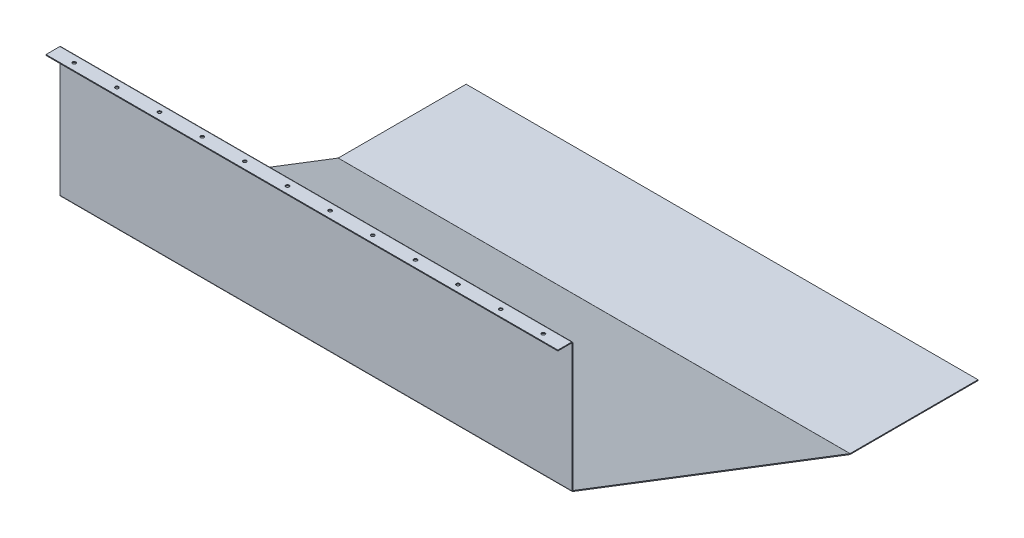
ISO-10303-21;
HEADER;
FILE_DESCRIPTION(('STEP AP214'),'2;1');
FILE_NAME('part.step','',(''),(''),'','','');
FILE_SCHEMA(('AUTOMOTIVE_DESIGN { 1 0 10303 214 1 1 1 1 }'));
ENDSEC;
DATA;
#1=APPLICATION_CONTEXT('core data for automotive mechanical design processes');
#2=APPLICATION_PROTOCOL_DEFINITION('international standard','automotive_design',2000,#1);
#3=PRODUCT_CONTEXT('',#1,'mechanical');
#4=PRODUCT('Part','Part','',(#3));
#5=PRODUCT_RELATED_PRODUCT_CATEGORY('part','',(#4));
#6=PRODUCT_DEFINITION_FORMATION('','',#4);
#7=PRODUCT_DEFINITION_CONTEXT('part definition',#1,'design');
#8=PRODUCT_DEFINITION('design','',#6,#7);
#9=PRODUCT_DEFINITION_SHAPE('','',#8);
#10=(LENGTH_UNIT() NAMED_UNIT(*) SI_UNIT(.MILLI.,.METRE.));
#11=(NAMED_UNIT(*) PLANE_ANGLE_UNIT() SI_UNIT($,.RADIAN.));
#12=(NAMED_UNIT(*) SI_UNIT($,.STERADIAN.) SOLID_ANGLE_UNIT());
#13=UNCERTAINTY_MEASURE_WITH_UNIT(LENGTH_MEASURE(1.E-05),#10,'distance_accuracy_value','');
#14=(GEOMETRIC_REPRESENTATION_CONTEXT(3) GLOBAL_UNCERTAINTY_ASSIGNED_CONTEXT((#13)) GLOBAL_UNIT_ASSIGNED_CONTEXT((#10,
#11,#12)) REPRESENTATION_CONTEXT('',''));
#15=CARTESIAN_POINT('',(0.,0.,0.));
#16=DIRECTION('',(0.,0.,1.));
#17=DIRECTION('',(1.,0.,0.));
#18=AXIS2_PLACEMENT_3D('',#15,#16,#17);
#19=CARTESIAN_POINT('',(600.,-300.181606157762,-0.472176010181132));
#20=DIRECTION('',(1.,0.,0.));
#21=DIRECTION('',(0.,0.,-1.));
#22=AXIS2_PLACEMENT_3D('',#19,#20,#21);
#23=PLANE('',#22);
#24=DIRECTION('',(0.,-0.933345606203062,0.358979079308862));
#25=VECTOR('',#24,1.);
#26=CARTESIAN_POINT('',(600.,-300.181606157762,-0.472176010181132));
#27=LINE('',#26,#25);
#28=CARTESIAN_POINT('',(600.,-300.181606157762,-0.472176010181132));
#29=VERTEX_POINT('',#28);
#30=CARTESIAN_POINT('',(600.,-302.048297370168,0.245782148436592));
#31=VERTEX_POINT('',#30);
#32=EDGE_CURVE('E13',#29,#31,#27,.T.);
#33=ORIENTED_EDGE('',*,*,#32,.F.);
#34=CARTESIAN_POINT('',(600.,-299.494103784233,-0.73660000000003));
#35=DIRECTION('',(-1.,0.,0.));
#36=DIRECTION('',(0.,0.,1.));
#37=AXIS2_PLACEMENT_3D('',#34,#35,#36);
#38=CIRCLE('',#37,0.7366);
#39=CARTESIAN_POINT('',(600.,-299.494103784233,0.));
#40=VERTEX_POINT('',#39);
#41=EDGE_CURVE('E202',#29,#40,#38,.T.);
#42=ORIENTED_EDGE('',*,*,#41,.T.);
#43=DIRECTION('',(0.,0.,-1.));
#44=VECTOR('',#43,1.);
#45=CARTESIAN_POINT('',(600.,-299.494103784233,1.99999999999996));
#46=LINE('',#45,#44);
#47=CARTESIAN_POINT('',(600.,-299.494103784233,1.99999999999996));
#48=VERTEX_POINT('',#47);
#49=EDGE_CURVE('E73',#48,#40,#46,.T.);
#50=ORIENTED_EDGE('',*,*,#49,.F.);
#51=CARTESIAN_POINT('',(600.,-299.494103784233,-0.73660000000003));
#52=DIRECTION('',(1.,0.,0.));
#53=DIRECTION('',(0.,0.,-1.));
#54=AXIS2_PLACEMENT_3D('',#51,#52,#53);
#55=CIRCLE('',#54,2.7366);
#56=EDGE_CURVE('E304',#31,#48,#55,.F.);
#57=ORIENTED_EDGE('',*,*,#56,.F.);
#58=EDGE_LOOP('',(#33,#42,#50,#57));
#59=FACE_BOUND('',#58,.T.);
#60=ADVANCED_FACE('F64',(#59),#23,.T.);
#61=CARTESIAN_POINT('',(600.,-299.494103784233,1.99999999999996));
#62=DIRECTION('',(1.,0.,0.));
#63=DIRECTION('',(0.,0.,-1.));
#64=AXIS2_PLACEMENT_3D('',#61,#62,#63);
#65=PLANE('',#64);
#66=DIRECTION('',(0.,0.358979079308869,0.93334560620306));
#67=VECTOR('',#66,1.);
#68=CARTESIAN_POINT('',(600.,-300.,0.));
#69=LINE('',#68,#67);
#70=CARTESIAN_POINT('',(600.,-549.95090237353,-649.872346171177));
#71=VERTEX_POINT('',#70);
#72=EDGE_CURVE('E165',#71,#29,#69,.T.);
#73=ORIENTED_EDGE('',*,*,#72,.T.);
#74=ORIENTED_EDGE('',*,*,#32,.T.);
#75=DIRECTION('',(0.,0.358979079308869,0.93334560620306));
#76=VECTOR('',#75,1.);
#77=CARTESIAN_POINT('',(600.,-301.866691212406,0.717958158617702));
#78=LINE('',#77,#76);
#79=CARTESIAN_POINT('',(600.,-551.817593585936,-649.154388012559));
#80=VERTEX_POINT('',#79);
#81=EDGE_CURVE('E168',#80,#31,#78,.T.);
#82=ORIENTED_EDGE('',*,*,#81,.F.);
#83=DIRECTION('',(0.,0.933345606203095,-0.358979079308776));
#84=VECTOR('',#83,1.);
#85=CARTESIAN_POINT('',(600.,-551.817593585936,-649.154388012559));
#86=LINE('',#85,#84);
#87=EDGE_CURVE('E161',#80,#71,#86,.T.);
#88=ORIENTED_EDGE('',*,*,#87,.T.);
#89=EDGE_LOOP('',(#73,#74,#82,#88));
#90=FACE_BOUND('',#89,.T.);
#91=ADVANCED_FACE('F163',(#90),#65,.T.);
#92=CARTESIAN_POINT('',(-600.,-299.494103784233,0.));
#93=DIRECTION('',(-1.,0.,0.));
#94=DIRECTION('',(0.,0.,1.));
#95=AXIS2_PLACEMENT_3D('',#92,#93,#94);
#96=PLANE('',#95);
#97=DIRECTION('',(0.,0.,1.));
#98=VECTOR('',#97,1.);
#99=CARTESIAN_POINT('',(-600.,-299.494103784233,0.));
#100=LINE('',#99,#98);
#101=CARTESIAN_POINT('',(-600.,-299.494103784233,0.));
#102=VERTEX_POINT('',#101);
#103=CARTESIAN_POINT('',(-600.,-299.494103784233,1.99999999999996));
#104=VERTEX_POINT('',#103);
#105=EDGE_CURVE('E126',#102,#104,#100,.T.);
#106=ORIENTED_EDGE('',*,*,#105,.F.);
#107=CARTESIAN_POINT('',(-600.,-299.494103784233,-0.73660000000003));
#108=DIRECTION('',(-1.,0.,0.));
#109=DIRECTION('',(0.,0.,1.));
#110=AXIS2_PLACEMENT_3D('',#107,#108,#109);
#111=CIRCLE('',#110,0.7366);
#112=CARTESIAN_POINT('',(-600.,-300.181606157762,-0.472176010181132));
#113=VERTEX_POINT('',#112);
#114=EDGE_CURVE('E252',#113,#102,#111,.T.);
#115=ORIENTED_EDGE('',*,*,#114,.F.);
#116=DIRECTION('',(0.,0.933345606203062,-0.358979079308862));
#117=VECTOR('',#116,1.);
#118=CARTESIAN_POINT('',(-600.,-302.048297370168,0.245782148436592));
#119=LINE('',#118,#117);
#120=CARTESIAN_POINT('',(-600.,-302.048297370168,0.245782148436592));
#121=VERTEX_POINT('',#120);
#122=EDGE_CURVE('E119',#121,#113,#119,.T.);
#123=ORIENTED_EDGE('',*,*,#122,.F.);
#124=CARTESIAN_POINT('',(-600.,-299.494103784233,-0.73660000000003));
#125=DIRECTION('',(1.,0.,0.));
#126=DIRECTION('',(0.,0.,-1.));
#127=AXIS2_PLACEMENT_3D('',#124,#125,#126);
#128=CIRCLE('',#127,2.7366);
#129=EDGE_CURVE('E225',#121,#104,#128,.F.);
#130=ORIENTED_EDGE('',*,*,#129,.T.);
#131=EDGE_LOOP('',(#106,#115,#123,#130));
#132=FACE_BOUND('',#131,.T.);
#133=ADVANCED_FACE('F354',(#132),#96,.T.);
#134=CARTESIAN_POINT('',(-600.,-302.048297370168,0.245782148436592));
#135=DIRECTION('',(-1.,0.,0.));
#136=DIRECTION('',(0.,0.,1.));
#137=AXIS2_PLACEMENT_3D('',#134,#135,#136);
#138=PLANE('',#137);
#139=DIRECTION('',(0.,1.,0.));
#140=VECTOR('',#139,1.);
#141=CARTESIAN_POINT('',(-600.,0.,0.));
#142=LINE('',#141,#140);
#143=CARTESIAN_POINT('',(-600.,1.19699311893705E-13,0.));
#144=VERTEX_POINT('',#143);
#145=EDGE_CURVE('E212',#102,#144,#142,.T.);
#146=ORIENTED_EDGE('',*,*,#145,.F.);
#147=ORIENTED_EDGE('',*,*,#105,.T.);
#148=DIRECTION('',(0.,1.,0.));
#149=VECTOR('',#148,1.);
#150=CARTESIAN_POINT('',(-600.,0.,2.));
#151=LINE('',#150,#149);
#152=CARTESIAN_POINT('',(-600.,0.,2.));
#153=VERTEX_POINT('',#152);
#154=EDGE_CURVE('E221',#104,#153,#151,.T.);
#155=ORIENTED_EDGE('',*,*,#154,.T.);
#156=DIRECTION('',(0.,0.,-1.));
#157=VECTOR('',#156,1.);
#158=CARTESIAN_POINT('',(-600.,0.,2.));
#159=LINE('',#158,#157);
#160=EDGE_CURVE('E216',#153,#144,#159,.T.);
#161=ORIENTED_EDGE('',*,*,#160,.T.);
#162=EDGE_LOOP('',(#146,#147,#155,#161));
#163=FACE_BOUND('',#162,.T.);
#164=ADVANCED_FACE('F362',(#163),#138,.T.);
#165=CARTESIAN_POINT('',(600.,-550.,-650.136770160996));
#166=DIRECTION('',(1.,0.,0.));
#167=DIRECTION('',(0.,0.,-1.));
#168=AXIS2_PLACEMENT_3D('',#165,#166,#167);
#169=PLANE('',#168);
#170=DIRECTION('',(0.,-1.,0.));
#171=VECTOR('',#170,1.);
#172=CARTESIAN_POINT('',(600.,-550.,-650.136770160996));
#173=LINE('',#172,#171);
#174=CARTESIAN_POINT('',(600.,-550.,-650.136770160996));
#175=VERTEX_POINT('',#174);
#176=CARTESIAN_POINT('',(600.,-552.,-650.136770160996));
#177=VERTEX_POINT('',#176);
#178=EDGE_CURVE('E174',#175,#177,#173,.T.);
#179=ORIENTED_EDGE('',*,*,#178,.F.);
#180=CARTESIAN_POINT('',(600.,-549.2634,-650.136770160996));
#181=DIRECTION('',(-1.,0.,0.));
#182=DIRECTION('',(0.,0.,1.));
#183=AXIS2_PLACEMENT_3D('',#180,#181,#182);
#184=CIRCLE('',#183,0.7366);
#185=EDGE_CURVE('E178',#175,#71,#184,.T.);
#186=ORIENTED_EDGE('',*,*,#185,.T.);
#187=ORIENTED_EDGE('',*,*,#87,.F.);
#188=CARTESIAN_POINT('',(600.,-549.2634,-650.136770160996));
#189=DIRECTION('',(1.,0.,0.));
#190=DIRECTION('',(0.,0.,-1.));
#191=AXIS2_PLACEMENT_3D('',#188,#189,#190);
#192=CIRCLE('',#191,2.7366);
#193=EDGE_CURVE('E312',#177,#80,#192,.F.);
#194=ORIENTED_EDGE('',*,*,#193,.F.);
#195=EDGE_LOOP('',(#179,#186,#187,#194));
#196=FACE_BOUND('',#195,.T.);
#197=ADVANCED_FACE('F180',(#196),#169,.T.);
#198=CARTESIAN_POINT('',(600.,-551.817593585936,-649.154388012559));
#199=DIRECTION('',(1.,0.,0.));
#200=DIRECTION('',(0.,0.,-1.));
#201=AXIS2_PLACEMENT_3D('',#198,#199,#200);
#202=PLANE('',#201);
#203=DIRECTION('',(0.,0.,1.));
#204=VECTOR('',#203,1.);
#205=CARTESIAN_POINT('',(600.,-550.,-950.));
#206=LINE('',#205,#204);
#207=CARTESIAN_POINT('',(600.,-550.,-950.));
#208=VERTEX_POINT('',#207);
#209=EDGE_CURVE('E185',#208,#175,#206,.T.);
#210=ORIENTED_EDGE('',*,*,#209,.T.);
#211=ORIENTED_EDGE('',*,*,#178,.T.);
#212=DIRECTION('',(0.,0.,1.));
#213=VECTOR('',#212,1.);
#214=CARTESIAN_POINT('',(600.,-552.,-950.));
#215=LINE('',#214,#213);
#216=CARTESIAN_POINT('',(600.,-552.,-950.));
#217=VERTEX_POINT('',#216);
#218=EDGE_CURVE('E322',#217,#177,#215,.T.);
#219=ORIENTED_EDGE('',*,*,#218,.F.);
#220=DIRECTION('',(0.,-1.,0.));
#221=VECTOR('',#220,1.);
#222=CARTESIAN_POINT('',(600.,-550.,-950.));
#223=LINE('',#222,#221);
#224=EDGE_CURVE('E326',#208,#217,#223,.T.);
#225=ORIENTED_EDGE('',*,*,#224,.F.);
#226=EDGE_LOOP('',(#210,#211,#219,#225));
#227=FACE_BOUND('',#226,.T.);
#228=ADVANCED_FACE('F335',(#227),#202,.T.);
#229=CARTESIAN_POINT('',(-600.,-549.95090237353,-649.872346171177));
#230=DIRECTION('',(-1.,0.,0.));
#231=DIRECTION('',(0.,0.,1.));
#232=AXIS2_PLACEMENT_3D('',#229,#230,#231);
#233=PLANE('',#232);
#234=DIRECTION('',(0.,-0.933345606203095,0.358979079308776));
#235=VECTOR('',#234,1.);
#236=CARTESIAN_POINT('',(-600.,-549.95090237353,-649.872346171177));
#237=LINE('',#236,#235);
#238=CARTESIAN_POINT('',(-600.,-549.95090237353,-649.872346171177));
#239=VERTEX_POINT('',#238);
#240=CARTESIAN_POINT('',(-600.,-551.817593585936,-649.154388012559));
#241=VERTEX_POINT('',#240);
#242=EDGE_CURVE('E175',#239,#241,#237,.T.);
#243=ORIENTED_EDGE('',*,*,#242,.F.);
#244=CARTESIAN_POINT('',(-600.,-549.2634,-650.136770160996));
#245=DIRECTION('',(-1.,0.,0.));
#246=DIRECTION('',(0.,0.,1.));
#247=AXIS2_PLACEMENT_3D('',#244,#245,#246);
#248=CIRCLE('',#247,0.7366);
#249=CARTESIAN_POINT('',(-600.,-550.,-650.136770160996));
#250=VERTEX_POINT('',#249);
#251=EDGE_CURVE('E192',#250,#239,#248,.T.);
#252=ORIENTED_EDGE('',*,*,#251,.F.);
#253=DIRECTION('',(0.,1.,0.));
#254=VECTOR('',#253,1.);
#255=CARTESIAN_POINT('',(-600.,-552.,-650.136770160996));
#256=LINE('',#255,#254);
#257=CARTESIAN_POINT('',(-600.,-552.,-650.136770160996));
#258=VERTEX_POINT('',#257);
#259=EDGE_CURVE('E291',#258,#250,#256,.T.);
#260=ORIENTED_EDGE('',*,*,#259,.F.);
#261=CARTESIAN_POINT('',(-600.,-549.2634,-650.136770160996));
#262=DIRECTION('',(1.,0.,0.));
#263=DIRECTION('',(0.,0.,-1.));
#264=AXIS2_PLACEMENT_3D('',#261,#262,#263);
#265=CIRCLE('',#264,2.7366);
#266=EDGE_CURVE('E231',#258,#241,#265,.F.);
#267=ORIENTED_EDGE('',*,*,#266,.T.);
#268=EDGE_LOOP('',(#243,#252,#260,#267));
#269=FACE_BOUND('',#268,.T.);
#270=ADVANCED_FACE('F342',(#269),#233,.T.);
#271=CARTESIAN_POINT('',(-600.,-552.,-650.136770160996));
#272=DIRECTION('',(-1.,0.,0.));
#273=DIRECTION('',(0.,0.,1.));
#274=AXIS2_PLACEMENT_3D('',#271,#272,#273);
#275=PLANE('',#274);
#276=DIRECTION('',(0.,0.358979079308869,0.93334560620306));
#277=VECTOR('',#276,1.);
#278=CARTESIAN_POINT('',(-600.,-300.,0.));
#279=LINE('',#278,#277);
#280=EDGE_CURVE('E249',#239,#113,#279,.T.);
#281=ORIENTED_EDGE('',*,*,#280,.F.);
#282=ORIENTED_EDGE('',*,*,#242,.T.);
#283=DIRECTION('',(0.,0.358979079308869,0.93334560620306));
#284=VECTOR('',#283,1.);
#285=CARTESIAN_POINT('',(-600.,-301.866691212406,0.717958158617702));
#286=LINE('',#285,#284);
#287=EDGE_CURVE('E228',#241,#121,#286,.T.);
#288=ORIENTED_EDGE('',*,*,#287,.T.);
#289=ORIENTED_EDGE('',*,*,#122,.T.);
#290=EDGE_LOOP('',(#281,#282,#288,#289));
#291=FACE_BOUND('',#290,.T.);
#292=ADVANCED_FACE('F344',(#291),#275,.T.);
#293=CARTESIAN_POINT('',(600.,0.,0.));
#294=DIRECTION('',(0.,0.,1.));
#295=DIRECTION('',(0.,-1.,0.));
#296=AXIS2_PLACEMENT_3D('',#293,#294,#295);
#297=PLANE('',#296);
#298=ORIENTED_EDGE('',*,*,#145,.T.);
#299=DIRECTION('',(-1.,0.,0.));
#300=VECTOR('',#299,1.);
#301=CARTESIAN_POINT('',(600.,0.,0.));
#302=LINE('',#301,#300);
#303=CARTESIAN_POINT('',(600.,0.,0.));
#304=VERTEX_POINT('',#303);
#305=EDGE_CURVE('E287',#304,#144,#302,.T.);
#306=ORIENTED_EDGE('',*,*,#305,.F.);
#307=DIRECTION('',(0.,1.,0.));
#308=VECTOR('',#307,1.);
#309=CARTESIAN_POINT('',(600.,0.,0.));
#310=LINE('',#309,#308);
#311=EDGE_CURVE('E132',#40,#304,#310,.T.);
#312=ORIENTED_EDGE('',*,*,#311,.F.);
#313=DIRECTION('',(-1.,0.,0.));
#314=VECTOR('',#313,1.);
#315=CARTESIAN_POINT('',(600.,-299.494103784233,0.));
#316=LINE('',#315,#314);
#317=EDGE_CURVE('E208',#40,#102,#316,.T.);
#318=ORIENTED_EDGE('',*,*,#317,.T.);
#319=EDGE_LOOP('',(#298,#306,#312,#318));
#320=FACE_BOUND('',#319,.T.);
#321=ADVANCED_FACE('F360',(#320),#297,.F.);
#322=CARTESIAN_POINT('',(600.,0.,2.));
#323=DIRECTION('',(0.,0.,1.));
#324=DIRECTION('',(0.,-1.,0.));
#325=AXIS2_PLACEMENT_3D('',#322,#323,#324);
#326=PLANE('',#325);
#327=ORIENTED_EDGE('',*,*,#154,.F.);
#328=DIRECTION('',(-1.,0.,0.));
#329=VECTOR('',#328,1.);
#330=CARTESIAN_POINT('',(600.,-299.494103784233,1.99999999999996));
#331=LINE('',#330,#329);
#332=EDGE_CURVE('E280',#48,#104,#331,.T.);
#333=ORIENTED_EDGE('',*,*,#332,.F.);
#334=DIRECTION('',(0.,1.,0.));
#335=VECTOR('',#334,1.);
#336=CARTESIAN_POINT('',(600.,0.,2.));
#337=LINE('',#336,#335);
#338=CARTESIAN_POINT('',(600.,0.,2.));
#339=VERTEX_POINT('',#338);
#340=EDGE_CURVE('E307',#48,#339,#337,.T.);
#341=ORIENTED_EDGE('',*,*,#340,.T.);
#342=DIRECTION('',(-1.,0.,0.));
#343=VECTOR('',#342,1.);
#344=CARTESIAN_POINT('',(600.,0.,2.));
#345=LINE('',#344,#343);
#346=EDGE_CURVE('E284',#339,#153,#345,.T.);
#347=ORIENTED_EDGE('',*,*,#346,.T.);
#348=EDGE_LOOP('',(#327,#333,#341,#347));
#349=FACE_BOUND('',#348,.T.);
#350=ADVANCED_FACE('F624',(#349),#326,.T.);
#351=CARTESIAN_POINT('',(600.,-299.494103784233,-0.73660000000003));
#352=DIRECTION('',(-1.,0.,0.));
#353=DIRECTION('',(0.,0.,1.));
#354=AXIS2_PLACEMENT_3D('',#351,#352,#353);
#355=CYLINDRICAL_SURFACE('',#354,2.7366);
#356=ORIENTED_EDGE('',*,*,#129,.F.);
#357=DIRECTION('',(-1.,0.,0.));
#358=VECTOR('',#357,1.);
#359=CARTESIAN_POINT('',(600.,-302.048297370168,0.245782148436592));
#360=LINE('',#359,#358);
#361=EDGE_CURVE('E276',#31,#121,#360,.T.);
#362=ORIENTED_EDGE('',*,*,#361,.F.);
#363=ORIENTED_EDGE('',*,*,#56,.T.);
#364=ORIENTED_EDGE('',*,*,#332,.T.);
#365=EDGE_LOOP('',(#356,#362,#363,#364));
#366=FACE_BOUND('',#365,.T.);
#367=ADVANCED_FACE('F351',(#366),#355,.T.);
#368=CARTESIAN_POINT('',(600.,-301.866691212406,0.717958158617702));
#369=DIRECTION('',(0.,-0.93334560620306,0.358979079308869));
#370=DIRECTION('',(0.,-0.358979079308869,-0.93334560620306));
#371=AXIS2_PLACEMENT_3D('',#368,#369,#370);
#372=PLANE('',#371);
#373=ORIENTED_EDGE('',*,*,#287,.F.);
#374=DIRECTION('',(-1.,0.,0.));
#375=VECTOR('',#374,1.);
#376=CARTESIAN_POINT('',(600.,-551.817593585936,-649.154388012559));
#377=LINE('',#376,#375);
#378=EDGE_CURVE('E272',#80,#241,#377,.T.);
#379=ORIENTED_EDGE('',*,*,#378,.F.);
#380=ORIENTED_EDGE('',*,*,#81,.T.);
#381=ORIENTED_EDGE('',*,*,#361,.T.);
#382=EDGE_LOOP('',(#373,#379,#380,#381));
#383=FACE_BOUND('',#382,.T.);
#384=ADVANCED_FACE('F349',(#383),#372,.T.);
#385=CARTESIAN_POINT('',(600.,-549.2634,-650.136770160996));
#386=DIRECTION('',(-1.,0.,0.));
#387=DIRECTION('',(0.,0.,1.));
#388=AXIS2_PLACEMENT_3D('',#385,#386,#387);
#389=CYLINDRICAL_SURFACE('',#388,2.7366);
#390=ORIENTED_EDGE('',*,*,#266,.F.);
#391=DIRECTION('',(-1.,0.,0.));
#392=VECTOR('',#391,1.);
#393=CARTESIAN_POINT('',(600.,-552.,-650.136770160996));
#394=LINE('',#393,#392);
#395=EDGE_CURVE('E268',#177,#258,#394,.T.);
#396=ORIENTED_EDGE('',*,*,#395,.F.);
#397=ORIENTED_EDGE('',*,*,#193,.T.);
#398=ORIENTED_EDGE('',*,*,#378,.T.);
#399=EDGE_LOOP('',(#390,#396,#397,#398));
#400=FACE_BOUND('',#399,.T.);
#401=ADVANCED_FACE('F347',(#400),#389,.T.);
#402=CARTESIAN_POINT('',(600.,-552.,-950.));
#403=DIRECTION('',(0.,-1.,0.));
#404=DIRECTION('',(0.,0.,-1.));
#405=AXIS2_PLACEMENT_3D('',#402,#403,#404);
#406=PLANE('',#405);
#407=DIRECTION('',(0.,0.,1.));
#408=VECTOR('',#407,1.);
#409=CARTESIAN_POINT('',(-600.,-552.,-950.));
#410=LINE('',#409,#408);
#411=CARTESIAN_POINT('',(-600.,-552.,-950.));
#412=VERTEX_POINT('',#411);
#413=EDGE_CURVE('E235',#412,#258,#410,.T.);
#414=ORIENTED_EDGE('',*,*,#413,.F.);
#415=DIRECTION('',(-1.,0.,0.));
#416=VECTOR('',#415,1.);
#417=CARTESIAN_POINT('',(600.,-552.,-950.));
#418=LINE('',#417,#416);
#419=EDGE_CURVE('E265',#217,#412,#418,.T.);
#420=ORIENTED_EDGE('',*,*,#419,.F.);
#421=ORIENTED_EDGE('',*,*,#218,.T.);
#422=ORIENTED_EDGE('',*,*,#395,.T.);
#423=EDGE_LOOP('',(#414,#420,#421,#422));
#424=FACE_BOUND('',#423,.T.);
#425=ADVANCED_FACE('F648',(#424),#406,.T.);
#426=CARTESIAN_POINT('',(600.,-550.,-950.));
#427=DIRECTION('',(0.,0.,-1.));
#428=DIRECTION('',(-1.,0.,0.));
#429=AXIS2_PLACEMENT_3D('',#426,#427,#428);
#430=PLANE('',#429);
#431=DIRECTION('',(0.,-1.,0.));
#432=VECTOR('',#431,1.);
#433=CARTESIAN_POINT('',(-600.,-550.,-950.));
#434=LINE('',#433,#432);
#435=CARTESIAN_POINT('',(-600.,-550.,-950.));
#436=VERTEX_POINT('',#435);
#437=EDGE_CURVE('E239',#436,#412,#434,.T.);
#438=ORIENTED_EDGE('',*,*,#437,.F.);
#439=DIRECTION('',(-1.,0.,0.));
#440=VECTOR('',#439,1.);
#441=CARTESIAN_POINT('',(600.,-550.,-950.));
#442=LINE('',#441,#440);
#443=EDGE_CURVE('E262',#208,#436,#442,.T.);
#444=ORIENTED_EDGE('',*,*,#443,.F.);
#445=ORIENTED_EDGE('',*,*,#224,.T.);
#446=ORIENTED_EDGE('',*,*,#419,.T.);
#447=EDGE_LOOP('',(#438,#444,#445,#446));
#448=FACE_BOUND('',#447,.T.);
#449=ADVANCED_FACE('F645',(#448),#430,.T.);
#450=CARTESIAN_POINT('',(600.,-550.,-950.));
#451=DIRECTION('',(0.,-1.,0.));
#452=DIRECTION('',(0.,0.,-1.));
#453=AXIS2_PLACEMENT_3D('',#450,#451,#452);
#454=PLANE('',#453);
#455=DIRECTION('',(0.,0.,1.));
#456=VECTOR('',#455,1.);
#457=CARTESIAN_POINT('',(-600.,-550.,-950.));
#458=LINE('',#457,#456);
#459=EDGE_CURVE('E243',#436,#250,#458,.T.);
#460=ORIENTED_EDGE('',*,*,#459,.T.);
#461=DIRECTION('',(-1.,0.,0.));
#462=VECTOR('',#461,1.);
#463=CARTESIAN_POINT('',(600.,-550.,-650.136770160996));
#464=LINE('',#463,#462);
#465=EDGE_CURVE('E195',#175,#250,#464,.T.);
#466=ORIENTED_EDGE('',*,*,#465,.F.);
#467=ORIENTED_EDGE('',*,*,#209,.F.);
#468=ORIENTED_EDGE('',*,*,#443,.T.);
#469=EDGE_LOOP('',(#460,#466,#467,#468));
#470=FACE_BOUND('',#469,.T.);
#471=ADVANCED_FACE('F339',(#470),#454,.F.);
#472=CARTESIAN_POINT('',(600.,-549.2634,-650.136770160996));
#473=DIRECTION('',(-1.,0.,0.));
#474=DIRECTION('',(0.,0.,1.));
#475=AXIS2_PLACEMENT_3D('',#472,#473,#474);
#476=CYLINDRICAL_SURFACE('',#475,0.7366);
#477=ORIENTED_EDGE('',*,*,#251,.T.);
#478=DIRECTION('',(-1.,0.,0.));
#479=VECTOR('',#478,1.);
#480=CARTESIAN_POINT('',(600.,-549.95090237353,-649.872346171177));
#481=LINE('',#480,#479);
#482=EDGE_CURVE('E189',#71,#239,#481,.T.);
#483=ORIENTED_EDGE('',*,*,#482,.F.);
#484=ORIENTED_EDGE('',*,*,#185,.F.);
#485=ORIENTED_EDGE('',*,*,#465,.T.);
#486=EDGE_LOOP('',(#477,#483,#484,#485));
#487=FACE_BOUND('',#486,.T.);
#488=ADVANCED_FACE('F190',(#487),#476,.F.);
#489=CARTESIAN_POINT('',(600.,-300.,0.));
#490=DIRECTION('',(0.,-0.93334560620306,0.358979079308869));
#491=DIRECTION('',(0.,-0.358979079308869,-0.93334560620306));
#492=AXIS2_PLACEMENT_3D('',#489,#490,#491);
#493=PLANE('',#492);
#494=ORIENTED_EDGE('',*,*,#280,.T.);
#495=DIRECTION('',(-1.,0.,0.));
#496=VECTOR('',#495,1.);
#497=CARTESIAN_POINT('',(600.,-300.181606157762,-0.472176010181132));
#498=LINE('',#497,#496);
#499=EDGE_CURVE('E196',#29,#113,#498,.T.);
#500=ORIENTED_EDGE('',*,*,#499,.F.);
#501=ORIENTED_EDGE('',*,*,#72,.F.);
#502=ORIENTED_EDGE('',*,*,#482,.T.);
#503=EDGE_LOOP('',(#494,#500,#501,#502));
#504=FACE_BOUND('',#503,.T.);
#505=ADVANCED_FACE('F198',(#504),#493,.F.);
#506=CARTESIAN_POINT('',(600.,-299.494103784233,-0.73660000000003));
#507=DIRECTION('',(-1.,0.,0.));
#508=DIRECTION('',(0.,0.,1.));
#509=AXIS2_PLACEMENT_3D('',#506,#507,#508);
#510=CYLINDRICAL_SURFACE('',#509,0.7366);
#511=ORIENTED_EDGE('',*,*,#114,.T.);
#512=ORIENTED_EDGE('',*,*,#317,.F.);
#513=ORIENTED_EDGE('',*,*,#41,.F.);
#514=ORIENTED_EDGE('',*,*,#499,.T.);
#515=EDGE_LOOP('',(#511,#512,#513,#514));
#516=FACE_BOUND('',#515,.T.);
#517=ADVANCED_FACE('F357',(#516),#510,.F.);
#518=CARTESIAN_POINT('',(600.,-299.494103784233,-0.73660000000003));
#519=DIRECTION('',(1.,0.,0.));
#520=DIRECTION('',(0.,0.,-1.));
#521=AXIS2_PLACEMENT_3D('',#518,#519,#520);
#522=PLANE('',#521);
#523=ORIENTED_EDGE('',*,*,#311,.T.);
#524=DIRECTION('',(0.,0.,-1.));
#525=VECTOR('',#524,1.);
#526=CARTESIAN_POINT('',(600.,0.,2.));
#527=LINE('',#526,#525);
#528=EDGE_CURVE('E316',#339,#304,#527,.T.);
#529=ORIENTED_EDGE('',*,*,#528,.F.);
#530=ORIENTED_EDGE('',*,*,#340,.F.);
#531=ORIENTED_EDGE('',*,*,#49,.T.);
#532=EDGE_LOOP('',(#523,#529,#530,#531));
#533=FACE_BOUND('',#532,.T.);
#534=ADVANCED_FACE('F625',(#533),#522,.T.);
#535=CARTESIAN_POINT('',(-600.,-299.494103784233,-0.73660000000003));
#536=DIRECTION('',(1.,0.,0.));
#537=DIRECTION('',(0.,0.,-1.));
#538=AXIS2_PLACEMENT_3D('',#535,#536,#537);
#539=PLANE('',#538);
#540=ORIENTED_EDGE('',*,*,#413,.T.);
#541=ORIENTED_EDGE('',*,*,#259,.T.);
#542=ORIENTED_EDGE('',*,*,#459,.F.);
#543=ORIENTED_EDGE('',*,*,#437,.T.);
#544=EDGE_LOOP('',(#540,#541,#542,#543));
#545=FACE_BOUND('',#544,.T.);
#546=ADVANCED_FACE('F627',(#545),#539,.F.);
#547=CARTESIAN_POINT('',(600.,0.,2.7366));
#548=DIRECTION('',(1.,0.,0.));
#549=DIRECTION('',(0.,1.,0.));
#550=AXIS2_PLACEMENT_3D('',#547,#548,#549);
#551=PLANE('',#550);
#552=DIRECTION('',(0.,1.,0.));
#553=VECTOR('',#552,1.);
#554=CARTESIAN_POINT('',(600.,2.7366,2.73659999999999));
#555=LINE('',#554,#553);
#556=CARTESIAN_POINT('',(600.,0.7366,2.7366));
#557=VERTEX_POINT('',#556);
#558=CARTESIAN_POINT('',(600.,2.7366,2.73659999999999));
#559=VERTEX_POINT('',#558);
#560=EDGE_CURVE('E418',#557,#559,#555,.T.);
#561=ORIENTED_EDGE('',*,*,#560,.F.);
#562=CARTESIAN_POINT('',(600.,0.,2.7366));
#563=DIRECTION('',(-1.,0.,0.));
#564=DIRECTION('',(0.,-1.,0.));
#565=AXIS2_PLACEMENT_3D('',#562,#563,#564);
#566=CIRCLE('',#565,0.736599999999956);
#567=EDGE_CURVE('E385',#339,#557,#566,.F.);
#568=ORIENTED_EDGE('',*,*,#567,.F.);
#569=ORIENTED_EDGE('',*,*,#528,.T.);
#570=CARTESIAN_POINT('',(600.,0.,2.7366));
#571=DIRECTION('',(-1.,0.,0.));
#572=DIRECTION('',(0.,-1.,0.));
#573=AXIS2_PLACEMENT_3D('',#570,#571,#572);
#574=CIRCLE('',#573,2.73659999999996);
#575=EDGE_CURVE('E217',#304,#559,#574,.F.);
#576=ORIENTED_EDGE('',*,*,#575,.T.);
#577=EDGE_LOOP('',(#561,#568,#569,#576));
#578=FACE_BOUND('',#577,.T.);
#579=ADVANCED_FACE('F407',(#578),#551,.T.);
#580=CARTESIAN_POINT('',(-600.,0.,2.7366));
#581=DIRECTION('',(1.,0.,0.));
#582=DIRECTION('',(0.,1.,0.));
#583=AXIS2_PLACEMENT_3D('',#580,#581,#582);
#584=PLANE('',#583);
#585=CARTESIAN_POINT('',(-600.,0.,2.7366));
#586=DIRECTION('',(-1.,0.,0.));
#587=DIRECTION('',(0.,-1.,0.));
#588=AXIS2_PLACEMENT_3D('',#585,#586,#587);
#589=CIRCLE('',#588,0.736599999999956);
#590=CARTESIAN_POINT('',(-600.,0.736599999999911,2.7366));
#591=VERTEX_POINT('',#590);
#592=EDGE_CURVE('E372',#591,#153,#589,.T.);
#593=ORIENTED_EDGE('',*,*,#592,.F.);
#594=DIRECTION('',(0.,1.,0.));
#595=VECTOR('',#594,1.);
#596=CARTESIAN_POINT('',(-600.,0.7366,2.7366));
#597=LINE('',#596,#595);
#598=CARTESIAN_POINT('',(-600.,2.7366,2.73659999999999));
#599=VERTEX_POINT('',#598);
#600=EDGE_CURVE('E424',#591,#599,#597,.T.);
#601=ORIENTED_EDGE('',*,*,#600,.T.);
#602=CARTESIAN_POINT('',(-600.,0.,2.7366));
#603=DIRECTION('',(-1.,0.,0.));
#604=DIRECTION('',(0.,-1.,0.));
#605=AXIS2_PLACEMENT_3D('',#602,#603,#604);
#606=CIRCLE('',#605,2.73659999999996);
#607=EDGE_CURVE('E375',#599,#144,#606,.T.);
#608=ORIENTED_EDGE('',*,*,#607,.T.);
#609=ORIENTED_EDGE('',*,*,#160,.F.);
#610=EDGE_LOOP('',(#593,#601,#608,#609));
#611=FACE_BOUND('',#610,.T.);
#612=ADVANCED_FACE('F370',(#611),#584,.F.);
#613=CARTESIAN_POINT('',(-600.,0.,2.7366));
#614=DIRECTION('',(-1.,0.,0.));
#615=DIRECTION('',(0.,1.,0.));
#616=AXIS2_PLACEMENT_3D('',#613,#614,#615);
#617=CYLINDRICAL_SURFACE('',#616,2.73659999999996);
#618=ORIENTED_EDGE('',*,*,#305,.T.);
#619=ORIENTED_EDGE('',*,*,#607,.F.);
#620=DIRECTION('',(-1.,0.,0.));
#621=VECTOR('',#620,1.);
#622=CARTESIAN_POINT('',(0.,2.7366,2.73659999999999));
#623=LINE('',#622,#621);
#624=EDGE_CURVE('E413',#559,#599,#623,.T.);
#625=ORIENTED_EDGE('',*,*,#624,.F.);
#626=ORIENTED_EDGE('',*,*,#575,.F.);
#627=EDGE_LOOP('',(#618,#619,#625,#626));
#628=FACE_BOUND('',#627,.T.);
#629=ADVANCED_FACE('F411',(#628),#617,.T.);
#630=CARTESIAN_POINT('',(-600.,0.,2.7366));
#631=DIRECTION('',(-1.,0.,0.));
#632=DIRECTION('',(0.,1.,0.));
#633=AXIS2_PLACEMENT_3D('',#630,#631,#632);
#634=CYLINDRICAL_SURFACE('',#633,0.736599999999956);
#635=ORIENTED_EDGE('',*,*,#346,.F.);
#636=ORIENTED_EDGE('',*,*,#567,.T.);
#637=DIRECTION('',(1.,0.,0.));
#638=VECTOR('',#637,1.);
#639=CARTESIAN_POINT('',(600.,0.7366,2.7366));
#640=LINE('',#639,#638);
#641=EDGE_CURVE('E383',#557,#591,#640,.F.);
#642=ORIENTED_EDGE('',*,*,#641,.T.);
#643=ORIENTED_EDGE('',*,*,#592,.T.);
#644=EDGE_LOOP('',(#635,#636,#642,#643));
#645=FACE_BOUND('',#644,.T.);
#646=ADVANCED_FACE('F379',(#645),#634,.F.);
#647=CARTESIAN_POINT('',(-600.,2.7366,1.99999999999999));
#648=DIRECTION('',(-1.,0.,0.));
#649=DIRECTION('',(0.,0.,1.));
#650=AXIS2_PLACEMENT_3D('',#647,#648,#649);
#651=PLANE('',#650);
#652=DIRECTION('',(0.,0.,-1.));
#653=VECTOR('',#652,1.);
#654=CARTESIAN_POINT('',(-600.,2.7366,1.99999999999999));
#655=LINE('',#654,#653);
#656=CARTESIAN_POINT('',(-600.,2.73660000000011,35.));
#657=VERTEX_POINT('',#656);
#658=EDGE_CURVE('E447',#657,#599,#655,.T.);
#659=ORIENTED_EDGE('',*,*,#658,.T.);
#660=ORIENTED_EDGE('',*,*,#600,.F.);
#661=DIRECTION('',(0.,0.,1.));
#662=VECTOR('',#661,1.);
#663=CARTESIAN_POINT('',(-600.,0.73659999999999,0.));
#664=LINE('',#663,#662);
#665=CARTESIAN_POINT('',(-600.,0.736600000000108,35.));
#666=VERTEX_POINT('',#665);
#667=EDGE_CURVE('E436',#666,#591,#664,.F.);
#668=ORIENTED_EDGE('',*,*,#667,.F.);
#669=DIRECTION('',(0.,-1.,0.));
#670=VECTOR('',#669,1.);
#671=CARTESIAN_POINT('',(-600.,2.73660000000011,35.));
#672=LINE('',#671,#670);
#673=EDGE_CURVE('E386',#657,#666,#672,.T.);
#674=ORIENTED_EDGE('',*,*,#673,.F.);
#675=EDGE_LOOP('',(#659,#660,#668,#674));
#676=FACE_BOUND('',#675,.T.);
#677=ADVANCED_FACE('F600',(#676),#651,.T.);
#678=CARTESIAN_POINT('',(600.,2.73660000000011,35.));
#679=DIRECTION('',(1.,0.,0.));
#680=DIRECTION('',(0.,0.,-1.));
#681=AXIS2_PLACEMENT_3D('',#678,#679,#680);
#682=PLANE('',#681);
#683=DIRECTION('',(0.,0.,-1.));
#684=VECTOR('',#683,1.);
#685=CARTESIAN_POINT('',(600.,0.73659999999999,0.));
#686=LINE('',#685,#684);
#687=CARTESIAN_POINT('',(600.,0.736600000000108,35.));
#688=VERTEX_POINT('',#687);
#689=EDGE_CURVE('E428',#557,#688,#686,.F.);
#690=ORIENTED_EDGE('',*,*,#689,.F.);
#691=ORIENTED_EDGE('',*,*,#560,.T.);
#692=DIRECTION('',(0.,0.,1.));
#693=VECTOR('',#692,1.);
#694=CARTESIAN_POINT('',(600.,2.73660000000011,35.));
#695=LINE('',#694,#693);
#696=CARTESIAN_POINT('',(600.,2.73660000000011,35.));
#697=VERTEX_POINT('',#696);
#698=EDGE_CURVE('E439',#559,#697,#695,.T.);
#699=ORIENTED_EDGE('',*,*,#698,.T.);
#700=DIRECTION('',(0.,-1.,0.));
#701=VECTOR('',#700,1.);
#702=CARTESIAN_POINT('',(600.,2.73660000000011,35.));
#703=LINE('',#702,#701);
#704=EDGE_CURVE('E395',#697,#688,#703,.T.);
#705=ORIENTED_EDGE('',*,*,#704,.T.);
#706=EDGE_LOOP('',(#690,#691,#699,#705));
#707=FACE_BOUND('',#706,.T.);
#708=ADVANCED_FACE('F588',(#707),#682,.T.);
#709=CARTESIAN_POINT('',(0.,2.73659999999999,0.));
#710=DIRECTION('',(0.,1.,0.));
#711=DIRECTION('',(0.,0.,1.));
#712=AXIS2_PLACEMENT_3D('',#709,#710,#711);
#713=PLANE('',#712);
#714=CARTESIAN_POINT('',(-550.,2.73660000000005,18.8683));
#715=DIRECTION('',(0.,1.,0.));
#716=DIRECTION('',(0.,0.,1.));
#717=AXIS2_PLACEMENT_3D('',#714,#715,#716);
#718=CIRCLE('',#717,3.99999999999999);
#719=CARTESIAN_POINT('',(-550.,2.73660000000007,22.8683));
#720=VERTEX_POINT('',#719);
#721=EDGE_CURVE('E421',#720,#720,#718,.T.);
#722=ORIENTED_EDGE('',*,*,#721,.F.);
#723=EDGE_LOOP('',(#722));
#724=FACE_BOUND('',#723,.T.);
#725=CARTESIAN_POINT('',(-450.,2.73660000000005,18.8683));
#726=DIRECTION('',(0.,1.,0.));
#727=DIRECTION('',(0.,0.,1.));
#728=AXIS2_PLACEMENT_3D('',#725,#726,#727);
#729=CIRCLE('',#728,3.99999999999999);
#730=CARTESIAN_POINT('',(-450.,2.73660000000007,22.8683));
#731=VERTEX_POINT('',#730);
#732=EDGE_CURVE('E457',#731,#731,#729,.T.);
#733=ORIENTED_EDGE('',*,*,#732,.F.);
#734=EDGE_LOOP('',(#733));
#735=FACE_BOUND('',#734,.T.);
#736=CARTESIAN_POINT('',(-350.,2.73660000000005,18.8683));
#737=DIRECTION('',(0.,1.,0.));
#738=DIRECTION('',(0.,0.,1.));
#739=AXIS2_PLACEMENT_3D('',#736,#737,#738);
#740=CIRCLE('',#739,3.99999999999999);
#741=CARTESIAN_POINT('',(-350.,2.73660000000007,22.8683));
#742=VERTEX_POINT('',#741);
#743=EDGE_CURVE('E461',#742,#742,#740,.T.);
#744=ORIENTED_EDGE('',*,*,#743,.F.);
#745=EDGE_LOOP('',(#744));
#746=FACE_BOUND('',#745,.T.);
#747=CARTESIAN_POINT('',(-250.,2.73660000000005,18.8683));
#748=DIRECTION('',(0.,1.,0.));
#749=DIRECTION('',(0.,0.,1.));
#750=AXIS2_PLACEMENT_3D('',#747,#748,#749);
#751=CIRCLE('',#750,3.99999999999999);
#752=CARTESIAN_POINT('',(-250.,2.73660000000007,22.8683));
#753=VERTEX_POINT('',#752);
#754=EDGE_CURVE('E465',#753,#753,#751,.T.);
#755=ORIENTED_EDGE('',*,*,#754,.F.);
#756=EDGE_LOOP('',(#755));
#757=FACE_BOUND('',#756,.T.);
#758=CARTESIAN_POINT('',(-150.,2.73660000000005,18.8683));
#759=DIRECTION('',(0.,1.,0.));
#760=DIRECTION('',(0.,0.,1.));
#761=AXIS2_PLACEMENT_3D('',#758,#759,#760);
#762=CIRCLE('',#761,3.99999999999999);
#763=CARTESIAN_POINT('',(-150.,2.73660000000007,22.8683));
#764=VERTEX_POINT('',#763);
#765=EDGE_CURVE('E469',#764,#764,#762,.T.);
#766=ORIENTED_EDGE('',*,*,#765,.F.);
#767=EDGE_LOOP('',(#766));
#768=FACE_BOUND('',#767,.T.);
#769=CARTESIAN_POINT('',(-49.9999999999999,2.73660000000005,18.8683));
#770=DIRECTION('',(0.,1.,0.));
#771=DIRECTION('',(0.,0.,1.));
#772=AXIS2_PLACEMENT_3D('',#769,#770,#771);
#773=CIRCLE('',#772,3.99999999999999);
#774=CARTESIAN_POINT('',(-49.9999999999999,2.73660000000007,22.8683));
#775=VERTEX_POINT('',#774);
#776=EDGE_CURVE('E473',#775,#775,#773,.T.);
#777=ORIENTED_EDGE('',*,*,#776,.F.);
#778=EDGE_LOOP('',(#777));
#779=FACE_BOUND('',#778,.T.);
#780=CARTESIAN_POINT('',(50.,2.73660000000005,18.8683));
#781=DIRECTION('',(0.,1.,0.));
#782=DIRECTION('',(0.,0.,1.));
#783=AXIS2_PLACEMENT_3D('',#780,#781,#782);
#784=CIRCLE('',#783,3.99999999999999);
#785=CARTESIAN_POINT('',(50.,2.73660000000007,22.8683));
#786=VERTEX_POINT('',#785);
#787=EDGE_CURVE('E477',#786,#786,#784,.T.);
#788=ORIENTED_EDGE('',*,*,#787,.F.);
#789=EDGE_LOOP('',(#788));
#790=FACE_BOUND('',#789,.T.);
#791=CARTESIAN_POINT('',(150.,2.73660000000005,18.8683));
#792=DIRECTION('',(0.,1.,0.));
#793=DIRECTION('',(0.,0.,1.));
#794=AXIS2_PLACEMENT_3D('',#791,#792,#793);
#795=CIRCLE('',#794,3.99999999999999);
#796=CARTESIAN_POINT('',(150.,2.73660000000007,22.8683));
#797=VERTEX_POINT('',#796);
#798=EDGE_CURVE('E481',#797,#797,#795,.T.);
#799=ORIENTED_EDGE('',*,*,#798,.F.);
#800=EDGE_LOOP('',(#799));
#801=FACE_BOUND('',#800,.T.);
#802=CARTESIAN_POINT('',(250.,2.73660000000005,18.8683));
#803=DIRECTION('',(0.,1.,0.));
#804=DIRECTION('',(0.,0.,1.));
#805=AXIS2_PLACEMENT_3D('',#802,#803,#804);
#806=CIRCLE('',#805,3.99999999999999);
#807=CARTESIAN_POINT('',(250.,2.73660000000007,22.8683));
#808=VERTEX_POINT('',#807);
#809=EDGE_CURVE('E485',#808,#808,#806,.T.);
#810=ORIENTED_EDGE('',*,*,#809,.F.);
#811=EDGE_LOOP('',(#810));
#812=FACE_BOUND('',#811,.T.);
#813=CARTESIAN_POINT('',(350.,2.73660000000005,18.8683));
#814=DIRECTION('',(0.,1.,0.));
#815=DIRECTION('',(0.,0.,1.));
#816=AXIS2_PLACEMENT_3D('',#813,#814,#815);
#817=CIRCLE('',#816,3.99999999999999);
#818=CARTESIAN_POINT('',(350.,2.73660000000007,22.8683));
#819=VERTEX_POINT('',#818);
#820=EDGE_CURVE('E489',#819,#819,#817,.T.);
#821=ORIENTED_EDGE('',*,*,#820,.F.);
#822=EDGE_LOOP('',(#821));
#823=FACE_BOUND('',#822,.T.);
#824=CARTESIAN_POINT('',(450.,2.73660000000005,18.8683));
#825=DIRECTION('',(0.,1.,0.));
#826=DIRECTION('',(0.,0.,1.));
#827=AXIS2_PLACEMENT_3D('',#824,#825,#826);
#828=CIRCLE('',#827,3.99999999999999);
#829=CARTESIAN_POINT('',(450.,2.73660000000007,22.8683));
#830=VERTEX_POINT('',#829);
#831=EDGE_CURVE('E493',#830,#830,#828,.T.);
#832=ORIENTED_EDGE('',*,*,#831,.F.);
#833=EDGE_LOOP('',(#832));
#834=FACE_BOUND('',#833,.T.);
#835=CARTESIAN_POINT('',(550.,2.73660000000005,18.8683));
#836=DIRECTION('',(0.,1.,0.));
#837=DIRECTION('',(0.,0.,1.));
#838=AXIS2_PLACEMENT_3D('',#835,#836,#837);
#839=CIRCLE('',#838,3.99999999999999);
#840=CARTESIAN_POINT('',(550.,2.73660000000007,22.8683));
#841=VERTEX_POINT('',#840);
#842=EDGE_CURVE('E497',#841,#841,#839,.T.);
#843=ORIENTED_EDGE('',*,*,#842,.F.);
#844=EDGE_LOOP('',(#843));
#845=FACE_BOUND('',#844,.T.);
#846=ORIENTED_EDGE('',*,*,#698,.F.);
#847=ORIENTED_EDGE('',*,*,#624,.T.);
#848=ORIENTED_EDGE('',*,*,#658,.F.);
#849=DIRECTION('',(-1.,0.,0.));
#850=VECTOR('',#849,1.);
#851=CARTESIAN_POINT('',(-600.,2.73660000000011,35.));
#852=LINE('',#851,#850);
#853=EDGE_CURVE('E443',#697,#657,#852,.T.);
#854=ORIENTED_EDGE('',*,*,#853,.F.);
#855=EDGE_LOOP('',(#846,#847,#848,#854));
#856=FACE_BOUND('',#855,.T.);
#857=ADVANCED_FACE('F557',(#724,#735,#746,#757,#768,#779,#790,#801,#812,#823,#834,#845,#856),
#713,.T.);
#858=CARTESIAN_POINT('',(0.,0.73659999999999,0.));
#859=DIRECTION('',(0.,1.,0.));
#860=DIRECTION('',(0.,0.,1.));
#861=AXIS2_PLACEMENT_3D('',#858,#859,#860);
#862=PLANE('',#861);
#863=CARTESIAN_POINT('',(-550.,0.736600000000054,18.8683));
#864=DIRECTION('',(0.,-1.,0.));
#865=DIRECTION('',(0.,0.,-1.));
#866=AXIS2_PLACEMENT_3D('',#863,#864,#865);
#867=CIRCLE('',#866,3.99999999999999);
#868=CARTESIAN_POINT('',(-550.,0.736600000000041,14.8683));
#869=VERTEX_POINT('',#868);
#870=EDGE_CURVE('E501',#869,#869,#867,.T.);
#871=ORIENTED_EDGE('',*,*,#870,.F.);
#872=EDGE_LOOP('',(#871));
#873=FACE_BOUND('',#872,.T.);
#874=CARTESIAN_POINT('',(-450.,0.736600000000054,18.8683));
#875=DIRECTION('',(0.,-1.,0.));
#876=DIRECTION('',(0.,0.,-1.));
#877=AXIS2_PLACEMENT_3D('',#874,#875,#876);
#878=CIRCLE('',#877,3.99999999999999);
#879=CARTESIAN_POINT('',(-450.,0.736600000000041,14.8683));
#880=VERTEX_POINT('',#879);
#881=EDGE_CURVE('E542',#880,#880,#878,.T.);
#882=ORIENTED_EDGE('',*,*,#881,.F.);
#883=EDGE_LOOP('',(#882));
#884=FACE_BOUND('',#883,.T.);
#885=CARTESIAN_POINT('',(-350.,0.736600000000054,18.8683));
#886=DIRECTION('',(0.,-1.,0.));
#887=DIRECTION('',(0.,0.,-1.));
#888=AXIS2_PLACEMENT_3D('',#885,#886,#887);
#889=CIRCLE('',#888,3.99999999999999);
#890=CARTESIAN_POINT('',(-350.,0.736600000000041,14.8683));
#891=VERTEX_POINT('',#890);
#892=EDGE_CURVE('E538',#891,#891,#889,.T.);
#893=ORIENTED_EDGE('',*,*,#892,.F.);
#894=EDGE_LOOP('',(#893));
#895=FACE_BOUND('',#894,.T.);
#896=CARTESIAN_POINT('',(-250.,0.736600000000054,18.8683));
#897=DIRECTION('',(0.,-1.,0.));
#898=DIRECTION('',(0.,0.,-1.));
#899=AXIS2_PLACEMENT_3D('',#896,#897,#898);
#900=CIRCLE('',#899,3.99999999999999);
#901=CARTESIAN_POINT('',(-250.,0.736600000000041,14.8683));
#902=VERTEX_POINT('',#901);
#903=EDGE_CURVE('E534',#902,#902,#900,.T.);
#904=ORIENTED_EDGE('',*,*,#903,.F.);
#905=EDGE_LOOP('',(#904));
#906=FACE_BOUND('',#905,.T.);
#907=CARTESIAN_POINT('',(-150.,0.736600000000054,18.8683));
#908=DIRECTION('',(0.,-1.,0.));
#909=DIRECTION('',(0.,0.,-1.));
#910=AXIS2_PLACEMENT_3D('',#907,#908,#909);
#911=CIRCLE('',#910,3.99999999999999);
#912=CARTESIAN_POINT('',(-150.,0.736600000000041,14.8683));
#913=VERTEX_POINT('',#912);
#914=EDGE_CURVE('E530',#913,#913,#911,.T.);
#915=ORIENTED_EDGE('',*,*,#914,.F.);
#916=EDGE_LOOP('',(#915));
#917=FACE_BOUND('',#916,.T.);
#918=CARTESIAN_POINT('',(-49.9999999999999,0.736600000000054,18.8683));
#919=DIRECTION('',(0.,-1.,0.));
#920=DIRECTION('',(0.,0.,-1.));
#921=AXIS2_PLACEMENT_3D('',#918,#919,#920);
#922=CIRCLE('',#921,3.99999999999999);
#923=CARTESIAN_POINT('',(-49.9999999999999,0.736600000000041,14.8683));
#924=VERTEX_POINT('',#923);
#925=EDGE_CURVE('E526',#924,#924,#922,.T.);
#926=ORIENTED_EDGE('',*,*,#925,.F.);
#927=EDGE_LOOP('',(#926));
#928=FACE_BOUND('',#927,.T.);
#929=CARTESIAN_POINT('',(50.,0.736600000000054,18.8683));
#930=DIRECTION('',(0.,-1.,0.));
#931=DIRECTION('',(0.,0.,-1.));
#932=AXIS2_PLACEMENT_3D('',#929,#930,#931);
#933=CIRCLE('',#932,3.99999999999999);
#934=CARTESIAN_POINT('',(50.,0.736600000000041,14.8683));
#935=VERTEX_POINT('',#934);
#936=EDGE_CURVE('E522',#935,#935,#933,.T.);
#937=ORIENTED_EDGE('',*,*,#936,.F.);
#938=EDGE_LOOP('',(#937));
#939=FACE_BOUND('',#938,.T.);
#940=CARTESIAN_POINT('',(150.,0.736600000000054,18.8683));
#941=DIRECTION('',(0.,-1.,0.));
#942=DIRECTION('',(0.,0.,-1.));
#943=AXIS2_PLACEMENT_3D('',#940,#941,#942);
#944=CIRCLE('',#943,3.99999999999999);
#945=CARTESIAN_POINT('',(150.,0.736600000000041,14.8683));
#946=VERTEX_POINT('',#945);
#947=EDGE_CURVE('E518',#946,#946,#944,.T.);
#948=ORIENTED_EDGE('',*,*,#947,.F.);
#949=EDGE_LOOP('',(#948));
#950=FACE_BOUND('',#949,.T.);
#951=CARTESIAN_POINT('',(250.,0.736600000000054,18.8683));
#952=DIRECTION('',(0.,-1.,0.));
#953=DIRECTION('',(0.,0.,-1.));
#954=AXIS2_PLACEMENT_3D('',#951,#952,#953);
#955=CIRCLE('',#954,3.99999999999999);
#956=CARTESIAN_POINT('',(250.,0.736600000000041,14.8683));
#957=VERTEX_POINT('',#956);
#958=EDGE_CURVE('E514',#957,#957,#955,.T.);
#959=ORIENTED_EDGE('',*,*,#958,.F.);
#960=EDGE_LOOP('',(#959));
#961=FACE_BOUND('',#960,.T.);
#962=CARTESIAN_POINT('',(350.,0.736600000000054,18.8683));
#963=DIRECTION('',(0.,-1.,0.));
#964=DIRECTION('',(0.,0.,-1.));
#965=AXIS2_PLACEMENT_3D('',#962,#963,#964);
#966=CIRCLE('',#965,3.99999999999999);
#967=CARTESIAN_POINT('',(350.,0.736600000000041,14.8683));
#968=VERTEX_POINT('',#967);
#969=EDGE_CURVE('E510',#968,#968,#966,.T.);
#970=ORIENTED_EDGE('',*,*,#969,.F.);
#971=EDGE_LOOP('',(#970));
#972=FACE_BOUND('',#971,.T.);
#973=CARTESIAN_POINT('',(450.,0.736600000000054,18.8683));
#974=DIRECTION('',(0.,-1.,0.));
#975=DIRECTION('',(0.,0.,-1.));
#976=AXIS2_PLACEMENT_3D('',#973,#974,#975);
#977=CIRCLE('',#976,3.99999999999999);
#978=CARTESIAN_POINT('',(450.,0.736600000000041,14.8683));
#979=VERTEX_POINT('',#978);
#980=EDGE_CURVE('E506',#979,#979,#977,.T.);
#981=ORIENTED_EDGE('',*,*,#980,.F.);
#982=EDGE_LOOP('',(#981));
#983=FACE_BOUND('',#982,.T.);
#984=CARTESIAN_POINT('',(550.,0.736600000000054,18.8683));
#985=DIRECTION('',(0.,-1.,0.));
#986=DIRECTION('',(0.,0.,-1.));
#987=AXIS2_PLACEMENT_3D('',#984,#985,#986);
#988=CIRCLE('',#987,3.99999999999999);
#989=CARTESIAN_POINT('',(550.,0.736600000000041,14.8683));
#990=VERTEX_POINT('',#989);
#991=EDGE_CURVE('E502',#990,#990,#988,.T.);
#992=ORIENTED_EDGE('',*,*,#991,.F.);
#993=EDGE_LOOP('',(#992));
#994=FACE_BOUND('',#993,.T.);
#995=ORIENTED_EDGE('',*,*,#641,.F.);
#996=ORIENTED_EDGE('',*,*,#689,.T.);
#997=DIRECTION('',(1.,0.,0.));
#998=VECTOR('',#997,1.);
#999=CARTESIAN_POINT('',(0.,0.736600000000108,35.));
#1000=LINE('',#999,#998);
#1001=EDGE_CURVE('E432',#688,#666,#1000,.F.);
#1002=ORIENTED_EDGE('',*,*,#1001,.T.);
#1003=ORIENTED_EDGE('',*,*,#667,.T.);
#1004=EDGE_LOOP('',(#995,#996,#1002,#1003));
#1005=FACE_BOUND('',#1004,.T.);
#1006=ADVANCED_FACE('F553',(#873,#884,#895,#906,#917,#928,#939,#950,#961,#972,#983,#994,#1005),
#862,.F.);
#1007=CARTESIAN_POINT('',(-600.,2.73660000000011,35.));
#1008=DIRECTION('',(0.,0.,1.));
#1009=DIRECTION('',(0.,-1.,0.));
#1010=AXIS2_PLACEMENT_3D('',#1007,#1008,#1009);
#1011=PLANE('',#1010);
#1012=ORIENTED_EDGE('',*,*,#1001,.F.);
#1013=ORIENTED_EDGE('',*,*,#704,.F.);
#1014=ORIENTED_EDGE('',*,*,#853,.T.);
#1015=ORIENTED_EDGE('',*,*,#673,.T.);
#1016=EDGE_LOOP('',(#1012,#1013,#1014,#1015));
#1017=FACE_BOUND('',#1016,.T.);
#1018=ADVANCED_FACE('F556',(#1017),#1011,.T.);
#1019=CARTESIAN_POINT('',(550.,3.73660000000005,18.8683));
#1020=DIRECTION('',(0.,-1.,0.));
#1021=DIRECTION('',(0.,0.,-1.));
#1022=AXIS2_PLACEMENT_3D('',#1019,#1020,#1021);
#1023=CYLINDRICAL_SURFACE('',#1022,3.99999999999999);
#1024=ORIENTED_EDGE('',*,*,#842,.T.);
#1025=EDGE_LOOP('',(#1024));
#1026=FACE_BOUND('',#1025,.T.);
#1027=ORIENTED_EDGE('',*,*,#991,.T.);
#1028=EDGE_LOOP('',(#1027));
#1029=FACE_BOUND('',#1028,.T.);
#1030=ADVANCED_FACE('F795',(#1026,#1029),#1023,.F.);
#1031=CARTESIAN_POINT('',(450.,3.73660000000005,18.8683));
#1032=DIRECTION('',(0.,-1.,0.));
#1033=DIRECTION('',(0.,0.,-1.));
#1034=AXIS2_PLACEMENT_3D('',#1031,#1032,#1033);
#1035=CYLINDRICAL_SURFACE('',#1034,3.99999999999999);
#1036=ORIENTED_EDGE('',*,*,#831,.T.);
#1037=EDGE_LOOP('',(#1036));
#1038=FACE_BOUND('',#1037,.T.);
#1039=ORIENTED_EDGE('',*,*,#980,.T.);
#1040=EDGE_LOOP('',(#1039));
#1041=FACE_BOUND('',#1040,.T.);
#1042=ADVANCED_FACE('F817',(#1038,#1041),#1035,.F.);
#1043=CARTESIAN_POINT('',(350.,3.73660000000005,18.8683));
#1044=DIRECTION('',(0.,-1.,0.));
#1045=DIRECTION('',(0.,0.,-1.));
#1046=AXIS2_PLACEMENT_3D('',#1043,#1044,#1045);
#1047=CYLINDRICAL_SURFACE('',#1046,3.99999999999999);
#1048=ORIENTED_EDGE('',*,*,#820,.T.);
#1049=EDGE_LOOP('',(#1048));
#1050=FACE_BOUND('',#1049,.T.);
#1051=ORIENTED_EDGE('',*,*,#969,.T.);
#1052=EDGE_LOOP('',(#1051));
#1053=FACE_BOUND('',#1052,.T.);
#1054=ADVANCED_FACE('F827',(#1050,#1053),#1047,.F.);
#1055=CARTESIAN_POINT('',(250.,3.73660000000005,18.8683));
#1056=DIRECTION('',(0.,-1.,0.));
#1057=DIRECTION('',(0.,0.,-1.));
#1058=AXIS2_PLACEMENT_3D('',#1055,#1056,#1057);
#1059=CYLINDRICAL_SURFACE('',#1058,3.99999999999999);
#1060=ORIENTED_EDGE('',*,*,#809,.T.);
#1061=EDGE_LOOP('',(#1060));
#1062=FACE_BOUND('',#1061,.T.);
#1063=ORIENTED_EDGE('',*,*,#958,.T.);
#1064=EDGE_LOOP('',(#1063));
#1065=FACE_BOUND('',#1064,.T.);
#1066=ADVANCED_FACE('F838',(#1062,#1065),#1059,.F.);
#1067=CARTESIAN_POINT('',(150.,3.73660000000005,18.8683));
#1068=DIRECTION('',(0.,-1.,0.));
#1069=DIRECTION('',(0.,0.,-1.));
#1070=AXIS2_PLACEMENT_3D('',#1067,#1068,#1069);
#1071=CYLINDRICAL_SURFACE('',#1070,3.99999999999999);
#1072=ORIENTED_EDGE('',*,*,#798,.T.);
#1073=EDGE_LOOP('',(#1072));
#1074=FACE_BOUND('',#1073,.T.);
#1075=ORIENTED_EDGE('',*,*,#947,.T.);
#1076=EDGE_LOOP('',(#1075));
#1077=FACE_BOUND('',#1076,.T.);
#1078=ADVANCED_FACE('F849',(#1074,#1077),#1071,.F.);
#1079=CARTESIAN_POINT('',(50.,3.73660000000005,18.8683));
#1080=DIRECTION('',(0.,-1.,0.));
#1081=DIRECTION('',(0.,0.,-1.));
#1082=AXIS2_PLACEMENT_3D('',#1079,#1080,#1081);
#1083=CYLINDRICAL_SURFACE('',#1082,3.99999999999999);
#1084=ORIENTED_EDGE('',*,*,#787,.T.);
#1085=EDGE_LOOP('',(#1084));
#1086=FACE_BOUND('',#1085,.T.);
#1087=ORIENTED_EDGE('',*,*,#936,.T.);
#1088=EDGE_LOOP('',(#1087));
#1089=FACE_BOUND('',#1088,.T.);
#1090=ADVANCED_FACE('F860',(#1086,#1089),#1083,.F.);
#1091=CARTESIAN_POINT('',(-49.9999999999999,3.73660000000005,18.8683));
#1092=DIRECTION('',(0.,-1.,0.));
#1093=DIRECTION('',(0.,0.,-1.));
#1094=AXIS2_PLACEMENT_3D('',#1091,#1092,#1093);
#1095=CYLINDRICAL_SURFACE('',#1094,3.99999999999999);
#1096=ORIENTED_EDGE('',*,*,#776,.T.);
#1097=EDGE_LOOP('',(#1096));
#1098=FACE_BOUND('',#1097,.T.);
#1099=ORIENTED_EDGE('',*,*,#925,.T.);
#1100=EDGE_LOOP('',(#1099));
#1101=FACE_BOUND('',#1100,.T.);
#1102=ADVANCED_FACE('F871',(#1098,#1101),#1095,.F.);
#1103=CARTESIAN_POINT('',(-150.,3.73660000000005,18.8683));
#1104=DIRECTION('',(0.,-1.,0.));
#1105=DIRECTION('',(0.,0.,-1.));
#1106=AXIS2_PLACEMENT_3D('',#1103,#1104,#1105);
#1107=CYLINDRICAL_SURFACE('',#1106,3.99999999999999);
#1108=ORIENTED_EDGE('',*,*,#765,.T.);
#1109=EDGE_LOOP('',(#1108));
#1110=FACE_BOUND('',#1109,.T.);
#1111=ORIENTED_EDGE('',*,*,#914,.T.);
#1112=EDGE_LOOP('',(#1111));
#1113=FACE_BOUND('',#1112,.T.);
#1114=ADVANCED_FACE('F882',(#1110,#1113),#1107,.F.);
#1115=CARTESIAN_POINT('',(-250.,3.73660000000005,18.8683));
#1116=DIRECTION('',(0.,-1.,0.));
#1117=DIRECTION('',(0.,0.,-1.));
#1118=AXIS2_PLACEMENT_3D('',#1115,#1116,#1117);
#1119=CYLINDRICAL_SURFACE('',#1118,3.99999999999999);
#1120=ORIENTED_EDGE('',*,*,#754,.T.);
#1121=EDGE_LOOP('',(#1120));
#1122=FACE_BOUND('',#1121,.T.);
#1123=ORIENTED_EDGE('',*,*,#903,.T.);
#1124=EDGE_LOOP('',(#1123));
#1125=FACE_BOUND('',#1124,.T.);
#1126=ADVANCED_FACE('F893',(#1122,#1125),#1119,.F.);
#1127=CARTESIAN_POINT('',(-350.,3.73660000000005,18.8683));
#1128=DIRECTION('',(0.,-1.,0.));
#1129=DIRECTION('',(0.,0.,-1.));
#1130=AXIS2_PLACEMENT_3D('',#1127,#1128,#1129);
#1131=CYLINDRICAL_SURFACE('',#1130,3.99999999999999);
#1132=ORIENTED_EDGE('',*,*,#743,.T.);
#1133=EDGE_LOOP('',(#1132));
#1134=FACE_BOUND('',#1133,.T.);
#1135=ORIENTED_EDGE('',*,*,#892,.T.);
#1136=EDGE_LOOP('',(#1135));
#1137=FACE_BOUND('',#1136,.T.);
#1138=ADVANCED_FACE('F904',(#1134,#1137),#1131,.F.);
#1139=CARTESIAN_POINT('',(-450.,3.73660000000005,18.8683));
#1140=DIRECTION('',(0.,-1.,0.));
#1141=DIRECTION('',(0.,0.,-1.));
#1142=AXIS2_PLACEMENT_3D('',#1139,#1140,#1141);
#1143=CYLINDRICAL_SURFACE('',#1142,3.99999999999999);
#1144=ORIENTED_EDGE('',*,*,#732,.T.);
#1145=EDGE_LOOP('',(#1144));
#1146=FACE_BOUND('',#1145,.T.);
#1147=ORIENTED_EDGE('',*,*,#881,.T.);
#1148=EDGE_LOOP('',(#1147));
#1149=FACE_BOUND('',#1148,.T.);
#1150=ADVANCED_FACE('F915',(#1146,#1149),#1143,.F.);
#1151=CARTESIAN_POINT('',(-550.,3.73660000000005,18.8683));
#1152=DIRECTION('',(0.,-1.,0.));
#1153=DIRECTION('',(0.,0.,-1.));
#1154=AXIS2_PLACEMENT_3D('',#1151,#1152,#1153);
#1155=CYLINDRICAL_SURFACE('',#1154,3.99999999999999);
#1156=ORIENTED_EDGE('',*,*,#721,.T.);
#1157=EDGE_LOOP('',(#1156));
#1158=FACE_BOUND('',#1157,.T.);
#1159=ORIENTED_EDGE('',*,*,#870,.T.);
#1160=EDGE_LOOP('',(#1159));
#1161=FACE_BOUND('',#1160,.T.);
#1162=ADVANCED_FACE('F551',(#1158,#1161),#1155,.F.);
#1163=CLOSED_SHELL('',(#60,#91,#133,#164,#197,#228,#270,#292,#321,#350,#367,#384,#401,#425,#449,
#471,#488,#505,#517,#534,#546,#579,#612,#629,#646,#677,#708,#857,#1006,#1018,#1030,#1042,#1054,
#1066,#1078,#1090,#1102,#1114,#1126,#1138,#1150,#1162));
#1164=MANIFOLD_SOLID_BREP('B2',#1163);
#1165=ADVANCED_BREP_SHAPE_REPRESENTATION('',(#18,#1164),#14);
#1166=SHAPE_DEFINITION_REPRESENTATION(#9,#1165);
ENDSEC;
END-ISO-10303-21;
